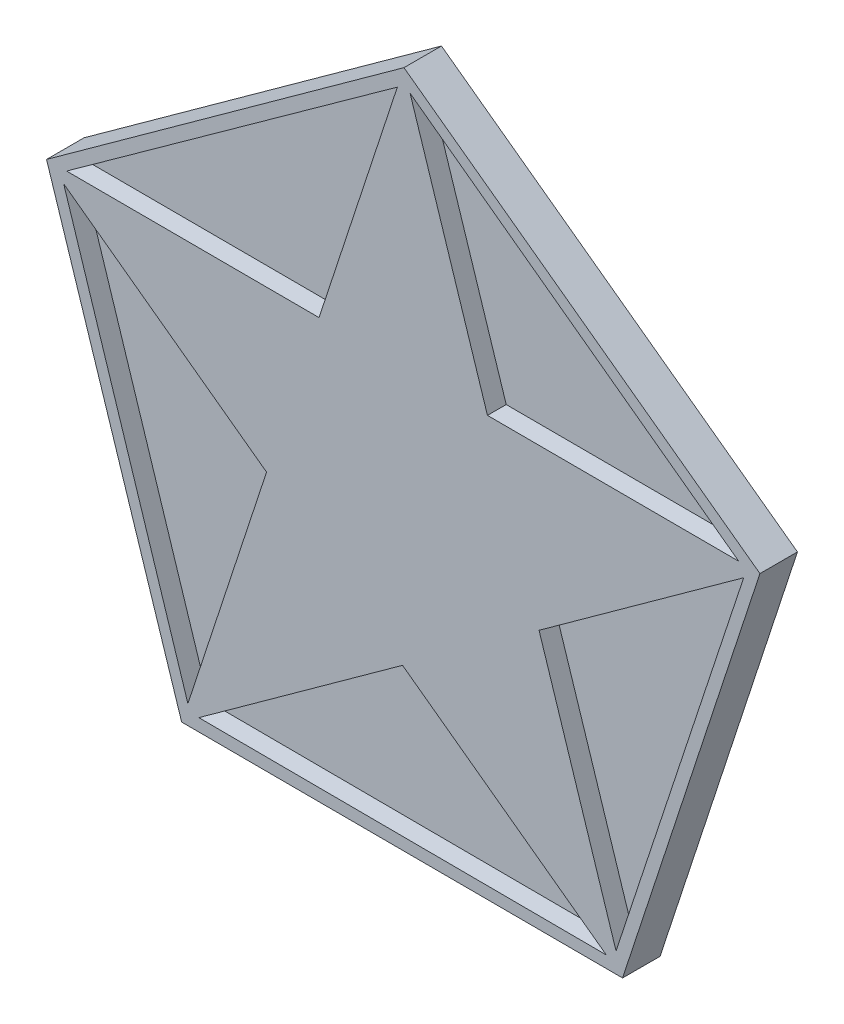
ISO-10303-21;
HEADER;
FILE_DESCRIPTION(('STEP AP214'),'2;1');
FILE_NAME('part.step','',(''),(''),'','','');
FILE_SCHEMA(('AUTOMOTIVE_DESIGN { 1 0 10303 214 1 1 1 1 }'));
ENDSEC;
DATA;
#1=APPLICATION_CONTEXT('core data for automotive mechanical design processes');
#2=APPLICATION_PROTOCOL_DEFINITION('international standard','automotive_design',2000,#1);
#3=PRODUCT_CONTEXT('',#1,'mechanical');
#4=PRODUCT('Part','Part','',(#3));
#5=PRODUCT_RELATED_PRODUCT_CATEGORY('part','',(#4));
#6=PRODUCT_DEFINITION_FORMATION('','',#4);
#7=PRODUCT_DEFINITION_CONTEXT('part definition',#1,'design');
#8=PRODUCT_DEFINITION('design','',#6,#7);
#9=PRODUCT_DEFINITION_SHAPE('','',#8);
#10=(LENGTH_UNIT() NAMED_UNIT(*) SI_UNIT(.MILLI.,.METRE.));
#11=(NAMED_UNIT(*) PLANE_ANGLE_UNIT() SI_UNIT($,.RADIAN.));
#12=(NAMED_UNIT(*) SI_UNIT($,.STERADIAN.) SOLID_ANGLE_UNIT());
#13=UNCERTAINTY_MEASURE_WITH_UNIT(LENGTH_MEASURE(1.E-05),#10,'distance_accuracy_value','');
#14=(GEOMETRIC_REPRESENTATION_CONTEXT(3) GLOBAL_UNCERTAINTY_ASSIGNED_CONTEXT((#13)) GLOBAL_UNIT_ASSIGNED_CONTEXT((#10,
#11,#12)) REPRESENTATION_CONTEXT('',''));
#15=CARTESIAN_POINT('',(0.,0.,0.));
#16=DIRECTION('',(0.,0.,1.));
#17=DIRECTION('',(1.,0.,0.));
#18=AXIS2_PLACEMENT_3D('',#15,#16,#17);
#19=CARTESIAN_POINT('',(9.14352620552275,2.92616651290582,0.5));
#20=DIRECTION('',(0.591365593008387,0.806403580972852,0.));
#21=DIRECTION('',(-0.806403580972852,0.591365593008387,0.));
#22=AXIS2_PLACEMENT_3D('',#19,#20,#21);
#23=PLANE('',#22);
#24=DIRECTION('',(0.,0.,-1.));
#25=VECTOR('',#24,1.);
#26=CARTESIAN_POINT('',(8.95345340474089,3.06555393280484,0.5));
#27=LINE('',#26,#25);
#28=CARTESIAN_POINT('',(8.95345340474089,3.06555393280484,1.));
#29=VERTEX_POINT('',#28);
#30=CARTESIAN_POINT('',(8.95345340474089,3.06555393280484,0.5));
#31=VERTEX_POINT('',#30);
#32=EDGE_CURVE('E332',#29,#31,#27,.T.);
#33=ORIENTED_EDGE('',*,*,#32,.F.);
#34=DIRECTION('',(-0.806403580972852,0.591365593008387,0.));
#35=VECTOR('',#34,1.);
#36=CARTESIAN_POINT('',(9.14352620552275,2.92616651290582,1.));
#37=LINE('',#36,#35);
#38=CARTESIAN_POINT('',(0.191271851090953,9.49118597708489,1.));
#39=VERTEX_POINT('',#38);
#40=EDGE_CURVE('E211',#29,#39,#37,.T.);
#41=ORIENTED_EDGE('',*,*,#40,.T.);
#42=DIRECTION('',(0.,0.,1.));
#43=VECTOR('',#42,1.);
#44=CARTESIAN_POINT('',(0.191271851090953,9.49118597708489,0.5));
#45=LINE('',#44,#43);
#46=CARTESIAN_POINT('',(0.191271851090954,9.49118597708489,0.5));
#47=VERTEX_POINT('',#46);
#48=EDGE_CURVE('E336',#47,#39,#45,.T.);
#49=ORIENTED_EDGE('',*,*,#48,.F.);
#50=DIRECTION('',(-0.806403580972852,0.591365593008387,0.));
#51=VECTOR('',#50,1.);
#52=CARTESIAN_POINT('',(9.14352620552275,2.92616651290582,0.5));
#53=LINE('',#52,#51);
#54=EDGE_CURVE('E231',#31,#47,#53,.T.);
#55=ORIENTED_EDGE('',*,*,#54,.F.);
#56=EDGE_LOOP('',(#33,#41,#49,#55));
#57=FACE_BOUND('',#56,.T.);
#58=ADVANCED_FACE('F45',(#57),#23,.F.);
#59=CARTESIAN_POINT('',(5.60845471588296,-7.79177499881913,0.5));
#60=DIRECTION('',(0.949677398576187,-0.313229689897949,0.));
#61=DIRECTION('',(0.313229689897949,0.949677398576187,0.));
#62=AXIS2_PLACEMENT_3D('',#59,#60,#61);
#63=PLANE('',#62);
#64=DIRECTION('',(0.,0.,-1.));
#65=VECTOR('',#64,1.);
#66=CARTESIAN_POINT('',(5.68228430425744,-7.5679319415142,0.5));
#67=LINE('',#66,#65);
#68=CARTESIAN_POINT('',(5.68228430425744,-7.5679319415142,1.));
#69=VERTEX_POINT('',#68);
#70=CARTESIAN_POINT('',(5.68228430425744,-7.56793194151421,0.5));
#71=VERTEX_POINT('',#70);
#72=EDGE_CURVE('E198',#69,#71,#67,.T.);
#73=ORIENTED_EDGE('',*,*,#72,.F.);
#74=DIRECTION('',(0.313229689897949,0.949677398576187,0.));
#75=VECTOR('',#74,1.);
#76=CARTESIAN_POINT('',(5.60845471588296,-7.79177499881913,1.));
#77=LINE('',#76,#75);
#78=CARTESIAN_POINT('',(9.08576052340843,2.75102742332854,1.));
#79=VERTEX_POINT('',#78);
#80=EDGE_CURVE('E228',#69,#79,#77,.T.);
#81=ORIENTED_EDGE('',*,*,#80,.T.);
#82=DIRECTION('',(0.,0.,1.));
#83=VECTOR('',#82,1.);
#84=CARTESIAN_POINT('',(9.08576052340843,2.75102742332853,0.5));
#85=LINE('',#84,#83);
#86=CARTESIAN_POINT('',(9.08576052340843,2.75102742332853,0.5));
#87=VERTEX_POINT('',#86);
#88=EDGE_CURVE('E201',#87,#79,#85,.T.);
#89=ORIENTED_EDGE('',*,*,#88,.F.);
#90=DIRECTION('',(0.313229689897949,0.949677398576187,0.));
#91=VECTOR('',#90,1.);
#92=CARTESIAN_POINT('',(5.60845471588296,-7.79177499881913,0.5));
#93=LINE('',#92,#91);
#94=EDGE_CURVE('E141',#71,#87,#93,.T.);
#95=ORIENTED_EDGE('',*,*,#94,.F.);
#96=EDGE_LOOP('',(#73,#81,#89,#95));
#97=FACE_BOUND('',#96,.T.);
#98=ADVANCED_FACE('F196',(#97),#63,.F.);
#99=CARTESIAN_POINT('',(-5.67731056674244,-7.74174829486772,0.5));
#100=DIRECTION('',(-0.00443268234072224,-0.999990175615374,0.));
#101=DIRECTION('',(0.999990175615374,-0.00443268234072224,0.));
#102=AXIS2_PLACEMENT_3D('',#99,#100,#101);
#103=PLANE('',#102);
#104=DIRECTION('',(0.,0.,-1.));
#105=VECTOR('',#104,1.);
#106=CARTESIAN_POINT('',(-5.44160857096974,-7.74279309720659,0.5));
#107=LINE('',#106,#105);
#108=CARTESIAN_POINT('',(-5.44160857096974,-7.74279309720659,1.));
#109=VERTEX_POINT('',#108);
#110=CARTESIAN_POINT('',(-5.44160857096975,-7.7427930972066,0.5));
#111=VERTEX_POINT('',#110);
#112=EDGE_CURVE('E306',#109,#111,#107,.T.);
#113=ORIENTED_EDGE('',*,*,#112,.F.);
#114=DIRECTION('',(0.999990175615374,-0.00443268234072224,0.));
#115=VECTOR('',#114,1.);
#116=CARTESIAN_POINT('',(-5.67731056674244,-7.74174829486772,1.));
#117=LINE('',#116,#115);
#118=CARTESIAN_POINT('',(5.42403696601749,-7.79095752548481,1.));
#119=VERTEX_POINT('',#118);
#120=EDGE_CURVE('E224',#109,#119,#117,.T.);
#121=ORIENTED_EDGE('',*,*,#120,.T.);
#122=DIRECTION('',(0.,0.,1.));
#123=VECTOR('',#122,1.);
#124=CARTESIAN_POINT('',(5.42403696601749,-7.79095752548481,0.5));
#125=LINE('',#124,#123);
#126=CARTESIAN_POINT('',(5.42403696601749,-7.79095752548481,0.5));
#127=VERTEX_POINT('',#126);
#128=EDGE_CURVE('E324',#127,#119,#125,.T.);
#129=ORIENTED_EDGE('',*,*,#128,.F.);
#130=DIRECTION('',(0.999990175615374,-0.00443268234072224,0.));
#131=VECTOR('',#130,1.);
#132=CARTESIAN_POINT('',(-5.67731056674244,-7.74174829486772,0.5));
#133=LINE('',#132,#131);
#134=EDGE_CURVE('E203',#111,#127,#133,.T.);
#135=ORIENTED_EDGE('',*,*,#134,.F.);
#136=EDGE_LOOP('',(#113,#121,#129,#135));
#137=FACE_BOUND('',#136,.T.);
#138=ADVANCED_FACE('F260',(#137),#103,.F.);
#139=CARTESIAN_POINT('',(-9.11722561081872,3.00711142024433,0.5));
#140=DIRECTION('',(-0.952416946924085,-0.304798227048328,0.));
#141=DIRECTION('',(0.304798227048328,-0.952416946924085,0.));
#142=AXIS2_PLACEMENT_3D('',#139,#140,#141);
#143=PLANE('',#142);
#144=DIRECTION('',(0.,0.,1.));
#145=VECTOR('',#144,1.);
#146=CARTESIAN_POINT('',(-5.73352132217376,-7.56610397898492,0.5));
#147=LINE('',#146,#145);
#148=CARTESIAN_POINT('',(-5.73352132217376,-7.56610397898492,0.5));
#149=VERTEX_POINT('',#148);
#150=CARTESIAN_POINT('',(-5.73352132217376,-7.56610397898493,1.));
#151=VERTEX_POINT('',#150);
#152=EDGE_CURVE('E216',#149,#151,#147,.T.);
#153=ORIENTED_EDGE('',*,*,#152,.F.);
#154=DIRECTION('',(0.304798227048328,-0.952416946924085,0.));
#155=VECTOR('',#154,1.);
#156=CARTESIAN_POINT('',(-9.11722561081872,3.00711142024433,0.5));
#157=LINE('',#156,#155);
#158=CARTESIAN_POINT('',(-9.04538335458949,2.78262263958246,0.5));
#159=VERTEX_POINT('',#158);
#160=EDGE_CURVE('E207',#159,#149,#157,.T.);
#161=ORIENTED_EDGE('',*,*,#160,.F.);
#162=DIRECTION('',(0.,0.,-1.));
#163=VECTOR('',#162,1.);
#164=CARTESIAN_POINT('',(-9.04538335458949,2.78262263958246,0.5));
#165=LINE('',#164,#163);
#166=CARTESIAN_POINT('',(-9.04538335458949,2.78262263958246,1.));
#167=VERTEX_POINT('',#166);
#168=EDGE_CURVE('E61',#167,#159,#165,.T.);
#169=ORIENTED_EDGE('',*,*,#168,.F.);
#170=DIRECTION('',(0.304798227048328,-0.952416946924085,0.));
#171=VECTOR('',#170,1.);
#172=CARTESIAN_POINT('',(-9.11722561081872,3.00711142024433,1.));
#173=LINE('',#172,#171);
#174=EDGE_CURVE('E220',#167,#151,#173,.T.);
#175=ORIENTED_EDGE('',*,*,#174,.T.);
#176=EDGE_LOOP('',(#153,#161,#169,#175));
#177=FACE_BOUND('',#176,.T.);
#178=ADVANCED_FACE('F288',(#177),#143,.F.);
#179=CARTESIAN_POINT('',(0.0425552561554533,9.60024536053669,0.5));
#180=DIRECTION('',(-0.584193362319767,0.811614511588799,0.));
#181=DIRECTION('',(-0.811614511588799,-0.584193362319767,0.));
#182=AXIS2_PLACEMENT_3D('',#179,#180,#181);
#183=PLANE('',#182);
#184=DIRECTION('',(0.,0.,-1.));
#185=VECTOR('',#184,1.);
#186=CARTESIAN_POINT('',(-0.148745783439104,9.46254846633351,0.5));
#187=LINE('',#186,#185);
#188=CARTESIAN_POINT('',(-0.148745783439104,9.46254846633351,1.));
#189=VERTEX_POINT('',#188);
#190=CARTESIAN_POINT('',(-0.148745783439103,9.46254846633351,0.5));
#191=VERTEX_POINT('',#190);
#192=EDGE_CURVE('E340',#189,#191,#187,.T.);
#193=ORIENTED_EDGE('',*,*,#192,.F.);
#194=DIRECTION('',(-0.811614511588799,-0.584193362319767,0.));
#195=VECTOR('',#194,1.);
#196=CARTESIAN_POINT('',(0.0425552561554533,9.60024536053669,1.));
#197=LINE('',#196,#195);
#198=CARTESIAN_POINT('',(-8.96754801834311,3.11484810405631,1.));
#199=VERTEX_POINT('',#198);
#200=EDGE_CURVE('E215',#189,#199,#197,.T.);
#201=ORIENTED_EDGE('',*,*,#200,.T.);
#202=DIRECTION('',(0.,0.,1.));
#203=VECTOR('',#202,1.);
#204=CARTESIAN_POINT('',(-8.96754801834311,3.11484810405631,0.5));
#205=LINE('',#204,#203);
#206=CARTESIAN_POINT('',(-8.96754801834311,3.11484810405631,0.5));
#207=VERTEX_POINT('',#206);
#208=EDGE_CURVE('E344',#207,#199,#205,.T.);
#209=ORIENTED_EDGE('',*,*,#208,.F.);
#210=DIRECTION('',(-0.811614511588799,-0.584193362319767,0.));
#211=VECTOR('',#210,1.);
#212=CARTESIAN_POINT('',(0.0425552561554533,9.60024536053669,0.5));
#213=LINE('',#212,#211);
#214=EDGE_CURVE('E313',#191,#207,#213,.T.);
#215=ORIENTED_EDGE('',*,*,#214,.F.);
#216=EDGE_LOOP('',(#193,#201,#209,#215));
#217=FACE_BOUND('',#216,.T.);
#218=ADVANCED_FACE('F264',(#217),#183,.F.);
#219=CARTESIAN_POINT('',(0.,0.,0.5));
#220=DIRECTION('',(0.,0.,1.));
#221=DIRECTION('',(1.,0.,0.));
#222=AXIS2_PLACEMENT_3D('',#219,#220,#221);
#223=PLANE('',#222);
#224=DIRECTION('',(0.807397156078042,-0.59000833244717,0.));
#225=VECTOR('',#224,1.);
#226=CARTESIAN_POINT('',(5.85557724977198,-8.10630711680435,0.5));
#227=LINE('',#226,#225);
#228=CARTESIAN_POINT('',(-0.0105064590408157,-3.81964566280041,0.5));
#229=VERTEX_POINT('',#228);
#230=EDGE_CURVE('E381',#229,#127,#227,.T.);
#231=ORIENTED_EDGE('',*,*,#230,.F.);
#232=DIRECTION('',(-0.810630711680435,-0.585557724977198,0.));
#233=VECTOR('',#232,1.);
#234=CARTESIAN_POINT('',(1.80947288205486,-2.50498666071512,0.5));
#235=LINE('',#234,#233);
#236=EDGE_CURVE('E11',#229,#111,#235,.T.);
#237=ORIENTED_EDGE('',*,*,#236,.T.);
#238=ORIENTED_EDGE('',*,*,#134,.T.);
#239=EDGE_LOOP('',(#231,#237,#238));
#240=FACE_BOUND('',#239,.T.);
#241=ADVANCED_FACE('F282',(#240),#223,.T.);
#242=DIRECTION('',(0.810630711680434,0.585557724977198,0.));
#243=VECTOR('',#242,1.);
#244=CARTESIAN_POINT('',(3.62945222315053,-1.19032765862984,0.5));
#245=LINE('',#244,#243);
#246=CARTESIAN_POINT('',(3.62945222315053,-1.19032765862984,0.5));
#247=VERTEX_POINT('',#246);
#248=EDGE_CURVE('E185',#247,#87,#245,.T.);
#249=ORIENTED_EDGE('',*,*,#248,.F.);
#250=DIRECTION('',(0.306399823935017,-0.951902908858141,0.));
#251=VECTOR('',#250,1.);
#252=CARTESIAN_POINT('',(2.94154175832112,0.946827526694121,0.5));
#253=LINE('',#252,#251);
#254=EDGE_CURVE('E54',#247,#71,#253,.T.);
#255=ORIENTED_EDGE('',*,*,#254,.T.);
#256=ORIENTED_EDGE('',*,*,#94,.T.);
#257=EDGE_LOOP('',(#249,#255,#256));
#258=FACE_BOUND('',#257,.T.);
#259=ADVANCED_FACE('F181',(#258),#223,.T.);
#260=DIRECTION('',(-0.306399823935017,0.951902908858141,0.));
#261=VECTOR('',#260,1.);
#262=CARTESIAN_POINT('',(2.25363129349171,3.08398271201809,0.5));
#263=LINE('',#262,#261);
#264=CARTESIAN_POINT('',(2.25363129349171,3.08398271201809,0.5));
#265=VERTEX_POINT('',#264);
#266=EDGE_CURVE('E375',#265,#47,#263,.T.);
#267=ORIENTED_EDGE('',*,*,#266,.F.);
#268=DIRECTION('',(0.999996217019259,-0.0027506266870268,0.));
#269=VECTOR('',#268,1.);
#270=CARTESIAN_POINT('',(0.00849990391472541,3.09015825369609,0.5));
#271=LINE('',#270,#269);
#272=EDGE_CURVE('E170',#265,#31,#271,.T.);
#273=ORIENTED_EDGE('',*,*,#272,.T.);
#274=ORIENTED_EDGE('',*,*,#54,.T.);
#275=EDGE_LOOP('',(#267,#273,#274));
#276=FACE_BOUND('',#275,.T.);
#277=ADVANCED_FACE('F499',(#276),#223,.T.);
#278=DIRECTION('',(-0.999996217019259,0.00275062668702662,0.));
#279=VECTOR('',#278,1.);
#280=CARTESIAN_POINT('',(-9.50202928075196,3.11631826804201,0.5));
#281=LINE('',#280,#279);
#282=CARTESIAN_POINT('',(-2.23663148566227,3.0963337953741,0.5));
#283=VERTEX_POINT('',#282);
#284=EDGE_CURVE('E370',#283,#207,#281,.T.);
#285=ORIENTED_EDGE('',*,*,#284,.F.);
#286=DIRECTION('',(0.311631826804201,0.950202928075196,0.));
#287=VECTOR('',#286,1.);
#288=CARTESIAN_POINT('',(-2.93628852880072,0.962995304706084,0.5));
#289=LINE('',#288,#287);
#290=EDGE_CURVE('E166',#283,#191,#289,.T.);
#291=ORIENTED_EDGE('',*,*,#290,.T.);
#292=ORIENTED_EDGE('',*,*,#214,.T.);
#293=EDGE_LOOP('',(#285,#291,#292));
#294=FACE_BOUND('',#293,.T.);
#295=ADVANCED_FACE('F501',(#294),#223,.T.);
#296=ORIENTED_EDGE('',*,*,#160,.T.);
#297=DIRECTION('',(-0.311631826804201,-0.950202928075196,0.));
#298=VECTOR('',#297,1.);
#299=CARTESIAN_POINT('',(-3.63594557193916,-1.17034318596193,0.5));
#300=LINE('',#299,#298);
#301=CARTESIAN_POINT('',(-3.63594557193916,-1.17034318596193,0.5));
#302=VERTEX_POINT('',#301);
#303=EDGE_CURVE('E311',#302,#149,#300,.T.);
#304=ORIENTED_EDGE('',*,*,#303,.F.);
#305=DIRECTION('',(-0.807397156078042,0.59000833244717,0.));
#306=VECTOR('',#305,1.);
#307=CARTESIAN_POINT('',(-1.82322601548999,-2.49499442438117,0.5));
#308=LINE('',#307,#306);
#309=EDGE_CURVE('E163',#302,#159,#308,.T.);
#310=ORIENTED_EDGE('',*,*,#309,.T.);
#311=EDGE_LOOP('',(#296,#304,#310));
#312=FACE_BOUND('',#311,.T.);
#313=ADVANCED_FACE('F285',(#312),#223,.T.);
#314=CARTESIAN_POINT('',(9.51902908858141,3.06399823935017,1.));
#315=DIRECTION('',(-0.590008332447169,-0.807397156078042,0.));
#316=DIRECTION('',(0.807397156078042,-0.590008332447169,0.));
#317=AXIS2_PLACEMENT_3D('',#314,#315,#316);
#318=PLANE('',#317);
#319=DIRECTION('',(-0.807397156078042,0.590008332447169,0.));
#320=VECTOR('',#319,1.);
#321=CARTESIAN_POINT('',(9.51902908858141,3.06399823935017,0.));
#322=LINE('',#321,#320);
#323=CARTESIAN_POINT('',(9.51902908858141,3.06399823935017,0.));
#324=VERTEX_POINT('',#323);
#325=CARTESIAN_POINT('',(0.0275062668702644,9.99996217019259,0.));
#326=VERTEX_POINT('',#325);
#327=EDGE_CURVE('E137',#324,#326,#322,.T.);
#328=ORIENTED_EDGE('',*,*,#327,.T.);
#329=DIRECTION('',(0.,0.,-1.));
#330=VECTOR('',#329,1.);
#331=CARTESIAN_POINT('',(0.0275062668702644,9.99996217019259,1.));
#332=LINE('',#331,#330);
#333=CARTESIAN_POINT('',(0.0275062668702644,9.99996217019259,1.));
#334=VERTEX_POINT('',#333);
#335=EDGE_CURVE('E160',#334,#326,#332,.T.);
#336=ORIENTED_EDGE('',*,*,#335,.F.);
#337=DIRECTION('',(-0.807397156078042,0.590008332447169,0.));
#338=VECTOR('',#337,1.);
#339=CARTESIAN_POINT('',(9.51902908858141,3.06399823935017,1.));
#340=LINE('',#339,#338);
#341=CARTESIAN_POINT('',(9.51902908858141,3.06399823935017,1.));
#342=VERTEX_POINT('',#341);
#343=EDGE_CURVE('E153',#342,#334,#340,.T.);
#344=ORIENTED_EDGE('',*,*,#343,.F.);
#345=DIRECTION('',(0.,0.,-1.));
#346=VECTOR('',#345,1.);
#347=CARTESIAN_POINT('',(9.51902908858141,3.06399823935017,1.));
#348=LINE('',#347,#346);
#349=EDGE_CURVE('E94',#342,#324,#348,.T.);
#350=ORIENTED_EDGE('',*,*,#349,.T.);
#351=EDGE_LOOP('',(#328,#336,#344,#350));
#352=FACE_BOUND('',#351,.T.);
#353=ADVANCED_FACE('F47',(#352),#318,.F.);
#354=CARTESIAN_POINT('',(0.0275062668702644,9.99996217019259,1.));
#355=DIRECTION('',(0.585557724977198,-0.810630711680435,0.));
#356=DIRECTION('',(0.810630711680435,0.585557724977198,0.));
#357=AXIS2_PLACEMENT_3D('',#354,#355,#356);
#358=PLANE('',#357);
#359=DIRECTION('',(-0.810630711680435,-0.585557724977198,0.));
#360=VECTOR('',#359,1.);
#361=CARTESIAN_POINT('',(0.0275062668702644,9.99996217019259,0.));
#362=LINE('',#361,#360);
#363=CARTESIAN_POINT('',(-9.50202928075196,3.11631826804201,0.));
#364=VERTEX_POINT('',#363);
#365=EDGE_CURVE('E140',#326,#364,#362,.T.);
#366=ORIENTED_EDGE('',*,*,#365,.T.);
#367=DIRECTION('',(0.,0.,-1.));
#368=VECTOR('',#367,1.);
#369=CARTESIAN_POINT('',(-9.50202928075196,3.11631826804201,1.));
#370=LINE('',#369,#368);
#371=CARTESIAN_POINT('',(-9.50202928075196,3.11631826804201,1.));
#372=VERTEX_POINT('',#371);
#373=EDGE_CURVE('E127',#372,#364,#370,.T.);
#374=ORIENTED_EDGE('',*,*,#373,.F.);
#375=DIRECTION('',(-0.810630711680435,-0.585557724977198,0.));
#376=VECTOR('',#375,1.);
#377=CARTESIAN_POINT('',(0.0275062668702644,9.99996217019259,1.));
#378=LINE('',#377,#376);
#379=EDGE_CURVE('E102',#334,#372,#378,.T.);
#380=ORIENTED_EDGE('',*,*,#379,.F.);
#381=ORIENTED_EDGE('',*,*,#335,.T.);
#382=EDGE_LOOP('',(#366,#374,#380,#381));
#383=FACE_BOUND('',#382,.T.);
#384=ADVANCED_FACE('F237',(#383),#358,.F.);
#385=CARTESIAN_POINT('',(-9.50202928075196,3.11631826804201,1.));
#386=DIRECTION('',(0.951902908858141,0.306399823935017,0.));
#387=DIRECTION('',(-0.306399823935017,0.951902908858141,0.));
#388=AXIS2_PLACEMENT_3D('',#385,#386,#387);
#389=PLANE('',#388);
#390=DIRECTION('',(0.306399823935017,-0.951902908858141,0.));
#391=VECTOR('',#390,1.);
#392=CARTESIAN_POINT('',(-9.50202928075196,3.11631826804201,0.));
#393=LINE('',#392,#391);
#394=CARTESIAN_POINT('',(-5.90008332447169,-8.07397156078042,0.));
#395=VERTEX_POINT('',#394);
#396=EDGE_CURVE('E122',#364,#395,#393,.T.);
#397=ORIENTED_EDGE('',*,*,#396,.T.);
#398=DIRECTION('',(0.,0.,-1.));
#399=VECTOR('',#398,1.);
#400=CARTESIAN_POINT('',(-5.90008332447169,-8.07397156078042,1.));
#401=LINE('',#400,#399);
#402=CARTESIAN_POINT('',(-5.90008332447169,-8.07397156078042,1.));
#403=VERTEX_POINT('',#402);
#404=EDGE_CURVE('E119',#403,#395,#401,.T.);
#405=ORIENTED_EDGE('',*,*,#404,.F.);
#406=DIRECTION('',(0.306399823935017,-0.951902908858141,0.));
#407=VECTOR('',#406,1.);
#408=CARTESIAN_POINT('',(-9.50202928075196,3.11631826804201,1.));
#409=LINE('',#408,#407);
#410=EDGE_CURVE('E108',#372,#403,#409,.T.);
#411=ORIENTED_EDGE('',*,*,#410,.F.);
#412=ORIENTED_EDGE('',*,*,#373,.T.);
#413=EDGE_LOOP('',(#397,#405,#411,#412));
#414=FACE_BOUND('',#413,.T.);
#415=ADVANCED_FACE('F120',(#414),#389,.F.);
#416=CARTESIAN_POINT('',(-5.90008332447169,-8.07397156078042,1.));
#417=DIRECTION('',(0.00275062668702626,0.999996217019259,0.));
#418=DIRECTION('',(-0.999996217019259,0.00275062668702626,0.));
#419=AXIS2_PLACEMENT_3D('',#416,#417,#418);
#420=PLANE('',#419);
#421=DIRECTION('',(0.999996217019259,-0.00275062668702626,0.));
#422=VECTOR('',#421,1.);
#423=CARTESIAN_POINT('',(-5.90008332447169,-8.07397156078042,0.));
#424=LINE('',#423,#422);
#425=CARTESIAN_POINT('',(5.85557724977198,-8.10630711680435,0.));
#426=VERTEX_POINT('',#425);
#427=EDGE_CURVE('E147',#395,#426,#424,.T.);
#428=ORIENTED_EDGE('',*,*,#427,.T.);
#429=DIRECTION('',(0.,0.,-1.));
#430=VECTOR('',#429,1.);
#431=CARTESIAN_POINT('',(5.85557724977198,-8.10630711680435,1.));
#432=LINE('',#431,#430);
#433=CARTESIAN_POINT('',(5.85557724977198,-8.10630711680435,1.));
#434=VERTEX_POINT('',#433);
#435=EDGE_CURVE('E128',#434,#426,#432,.T.);
#436=ORIENTED_EDGE('',*,*,#435,.F.);
#437=DIRECTION('',(0.999996217019259,-0.00275062668702626,0.));
#438=VECTOR('',#437,1.);
#439=CARTESIAN_POINT('',(-5.90008332447169,-8.07397156078042,1.));
#440=LINE('',#439,#438);
#441=EDGE_CURVE('E113',#403,#434,#440,.T.);
#442=ORIENTED_EDGE('',*,*,#441,.F.);
#443=ORIENTED_EDGE('',*,*,#404,.T.);
#444=EDGE_LOOP('',(#428,#436,#442,#443));
#445=FACE_BOUND('',#444,.T.);
#446=ADVANCED_FACE('F130',(#445),#420,.F.);
#447=CARTESIAN_POINT('',(5.85557724977198,-8.10630711680435,1.));
#448=DIRECTION('',(-0.950202928075196,0.311631826804201,0.));
#449=DIRECTION('',(-0.311631826804201,-0.950202928075196,0.));
#450=AXIS2_PLACEMENT_3D('',#447,#448,#449);
#451=PLANE('',#450);
#452=DIRECTION('',(0.311631826804201,0.950202928075196,0.));
#453=VECTOR('',#452,1.);
#454=CARTESIAN_POINT('',(5.85557724977198,-8.10630711680435,0.));
#455=LINE('',#454,#453);
#456=EDGE_CURVE('E150',#426,#324,#455,.T.);
#457=ORIENTED_EDGE('',*,*,#456,.T.);
#458=ORIENTED_EDGE('',*,*,#349,.F.);
#459=DIRECTION('',(0.311631826804201,0.950202928075196,0.));
#460=VECTOR('',#459,1.);
#461=CARTESIAN_POINT('',(5.85557724977198,-8.10630711680435,1.));
#462=LINE('',#461,#460);
#463=EDGE_CURVE('E70',#434,#342,#462,.T.);
#464=ORIENTED_EDGE('',*,*,#463,.F.);
#465=ORIENTED_EDGE('',*,*,#435,.T.);
#466=EDGE_LOOP('',(#457,#458,#464,#465));
#467=FACE_BOUND('',#466,.T.);
#468=ADVANCED_FACE('F242',(#467),#451,.F.);
#469=CARTESIAN_POINT('',(0.,0.,1.));
#470=DIRECTION('',(0.,0.,1.));
#471=DIRECTION('',(1.,0.,0.));
#472=AXIS2_PLACEMENT_3D('',#469,#470,#471);
#473=PLANE('',#472);
#474=DIRECTION('',(-0.311631826804201,-0.950202928075196,0.));
#475=VECTOR('',#474,1.);
#476=CARTESIAN_POINT('',(-3.63594557193916,-1.17034318596193,1.));
#477=LINE('',#476,#475);
#478=CARTESIAN_POINT('',(-3.63594557193916,-1.17034318596193,1.));
#479=VERTEX_POINT('',#478);
#480=EDGE_CURVE('E374',#479,#151,#477,.T.);
#481=ORIENTED_EDGE('',*,*,#480,.T.);
#482=ORIENTED_EDGE('',*,*,#174,.F.);
#483=DIRECTION('',(0.807397156078042,-0.59000833244717,0.));
#484=VECTOR('',#483,1.);
#485=CARTESIAN_POINT('',(-3.63594557193916,-1.17034318596193,1.));
#486=LINE('',#485,#484);
#487=EDGE_CURVE('E369',#167,#479,#486,.T.);
#488=ORIENTED_EDGE('',*,*,#487,.T.);
#489=EDGE_LOOP('',(#481,#482,#488));
#490=FACE_BOUND('',#489,.T.);
#491=ORIENTED_EDGE('',*,*,#410,.T.);
#492=ORIENTED_EDGE('',*,*,#441,.T.);
#493=ORIENTED_EDGE('',*,*,#463,.T.);
#494=ORIENTED_EDGE('',*,*,#343,.T.);
#495=ORIENTED_EDGE('',*,*,#379,.T.);
#496=EDGE_LOOP('',(#491,#492,#493,#494,#495));
#497=FACE_BOUND('',#496,.T.);
#498=DIRECTION('',(0.807397156078042,-0.59000833244717,0.));
#499=VECTOR('',#498,1.);
#500=CARTESIAN_POINT('',(5.85557724977198,-8.10630711680435,1.));
#501=LINE('',#500,#499);
#502=CARTESIAN_POINT('',(-0.0105064590408157,-3.81964566280041,1.));
#503=VERTEX_POINT('',#502);
#504=EDGE_CURVE('E414',#503,#119,#501,.T.);
#505=ORIENTED_EDGE('',*,*,#504,.T.);
#506=ORIENTED_EDGE('',*,*,#120,.F.);
#507=DIRECTION('',(0.810630711680434,0.585557724977198,0.));
#508=VECTOR('',#507,1.);
#509=CARTESIAN_POINT('',(-5.90008332447169,-8.07397156078042,1.));
#510=LINE('',#509,#508);
#511=EDGE_CURVE('E418',#109,#503,#510,.T.);
#512=ORIENTED_EDGE('',*,*,#511,.T.);
#513=EDGE_LOOP('',(#505,#506,#512));
#514=FACE_BOUND('',#513,.T.);
#515=DIRECTION('',(0.810630711680434,0.585557724977198,0.));
#516=VECTOR('',#515,1.);
#517=CARTESIAN_POINT('',(3.62945222315053,-1.19032765862984,1.));
#518=LINE('',#517,#516);
#519=CARTESIAN_POINT('',(3.62945222315053,-1.19032765862984,1.));
#520=VERTEX_POINT('',#519);
#521=EDGE_CURVE('E406',#520,#79,#518,.T.);
#522=ORIENTED_EDGE('',*,*,#521,.T.);
#523=ORIENTED_EDGE('',*,*,#80,.F.);
#524=DIRECTION('',(-0.306399823935017,0.951902908858141,0.));
#525=VECTOR('',#524,1.);
#526=CARTESIAN_POINT('',(5.85557724977198,-8.10630711680435,1.));
#527=LINE('',#526,#525);
#528=EDGE_CURVE('E410',#69,#520,#527,.T.);
#529=ORIENTED_EDGE('',*,*,#528,.T.);
#530=EDGE_LOOP('',(#522,#523,#529));
#531=FACE_BOUND('',#530,.T.);
#532=DIRECTION('',(-0.306399823935017,0.951902908858141,0.));
#533=VECTOR('',#532,1.);
#534=CARTESIAN_POINT('',(2.25363129349171,3.08398271201809,1.));
#535=LINE('',#534,#533);
#536=CARTESIAN_POINT('',(2.25363129349171,3.08398271201809,1.));
#537=VERTEX_POINT('',#536);
#538=EDGE_CURVE('E398',#537,#39,#535,.T.);
#539=ORIENTED_EDGE('',*,*,#538,.T.);
#540=ORIENTED_EDGE('',*,*,#40,.F.);
#541=DIRECTION('',(-0.999996217019259,0.0027506266870268,0.));
#542=VECTOR('',#541,1.);
#543=CARTESIAN_POINT('',(2.25363129349171,3.08398271201809,1.));
#544=LINE('',#543,#542);
#545=EDGE_CURVE('E402',#29,#537,#544,.T.);
#546=ORIENTED_EDGE('',*,*,#545,.T.);
#547=EDGE_LOOP('',(#539,#540,#546));
#548=FACE_BOUND('',#547,.T.);
#549=ORIENTED_EDGE('',*,*,#200,.F.);
#550=DIRECTION('',(-0.311631826804201,-0.950202928075196,0.));
#551=VECTOR('',#550,1.);
#552=CARTESIAN_POINT('',(0.0275062668702644,9.99996217019259,1.));
#553=LINE('',#552,#551);
#554=CARTESIAN_POINT('',(-2.23663148566227,3.0963337953741,1.));
#555=VERTEX_POINT('',#554);
#556=EDGE_CURVE('E394',#189,#555,#553,.T.);
#557=ORIENTED_EDGE('',*,*,#556,.T.);
#558=DIRECTION('',(-0.999996217019259,0.00275062668702662,0.));
#559=VECTOR('',#558,1.);
#560=CARTESIAN_POINT('',(-9.50202928075196,3.11631826804201,1.));
#561=LINE('',#560,#559);
#562=EDGE_CURVE('E390',#555,#199,#561,.T.);
#563=ORIENTED_EDGE('',*,*,#562,.T.);
#564=EDGE_LOOP('',(#549,#557,#563));
#565=FACE_BOUND('',#564,.T.);
#566=ADVANCED_FACE('F110',(#490,#497,#514,#531,#548,#565),#473,.T.);
#567=CARTESIAN_POINT('',(0.,0.,0.));
#568=DIRECTION('',(0.,0.,1.));
#569=DIRECTION('',(1.,0.,0.));
#570=AXIS2_PLACEMENT_3D('',#567,#568,#569);
#571=PLANE('',#570);
#572=ORIENTED_EDGE('',*,*,#327,.F.);
#573=ORIENTED_EDGE('',*,*,#456,.F.);
#574=ORIENTED_EDGE('',*,*,#427,.F.);
#575=ORIENTED_EDGE('',*,*,#396,.F.);
#576=ORIENTED_EDGE('',*,*,#365,.F.);
#577=EDGE_LOOP('',(#572,#573,#574,#575,#576));
#578=FACE_BOUND('',#577,.T.);
#579=ADVANCED_FACE('F239',(#578),#571,.F.);
#580=CARTESIAN_POINT('',(-3.63594557193916,-1.17034318596193,1.));
#581=DIRECTION('',(0.950202928075196,-0.311631826804201,0.));
#582=DIRECTION('',(0.311631826804201,0.950202928075196,0.));
#583=AXIS2_PLACEMENT_3D('',#580,#581,#582);
#584=PLANE('',#583);
#585=ORIENTED_EDGE('',*,*,#303,.T.);
#586=ORIENTED_EDGE('',*,*,#152,.T.);
#587=ORIENTED_EDGE('',*,*,#480,.F.);
#588=DIRECTION('',(0.,0.,-1.));
#589=VECTOR('',#588,1.);
#590=CARTESIAN_POINT('',(-3.63594557193916,-1.17034318596193,1.));
#591=LINE('',#590,#589);
#592=EDGE_CURVE('E365',#479,#302,#591,.T.);
#593=ORIENTED_EDGE('',*,*,#592,.T.);
#594=EDGE_LOOP('',(#585,#586,#587,#593));
#595=FACE_BOUND('',#594,.T.);
#596=ADVANCED_FACE('F266',(#595),#584,.F.);
#597=CARTESIAN_POINT('',(-5.90008332447169,-8.07397156078042,1.));
#598=DIRECTION('',(-0.585557724977198,0.810630711680434,0.));
#599=DIRECTION('',(-0.810630711680435,-0.585557724977198,0.));
#600=AXIS2_PLACEMENT_3D('',#597,#598,#599);
#601=PLANE('',#600);
#602=ORIENTED_EDGE('',*,*,#511,.F.);
#603=ORIENTED_EDGE('',*,*,#112,.T.);
#604=ORIENTED_EDGE('',*,*,#236,.F.);
#605=DIRECTION('',(0.,0.,-1.));
#606=VECTOR('',#605,1.);
#607=CARTESIAN_POINT('',(-0.0105064590408157,-3.81964566280041,1.));
#608=LINE('',#607,#606);
#609=EDGE_CURVE('E350',#503,#229,#608,.T.);
#610=ORIENTED_EDGE('',*,*,#609,.F.);
#611=EDGE_LOOP('',(#602,#603,#604,#610));
#612=FACE_BOUND('',#611,.T.);
#613=ADVANCED_FACE('F270',(#612),#601,.F.);
#614=CARTESIAN_POINT('',(5.85557724977198,-8.10630711680435,1.));
#615=DIRECTION('',(0.59000833244717,0.807397156078042,0.));
#616=DIRECTION('',(-0.807397156078042,0.59000833244717,0.));
#617=AXIS2_PLACEMENT_3D('',#614,#615,#616);
#618=PLANE('',#617);
#619=ORIENTED_EDGE('',*,*,#230,.T.);
#620=ORIENTED_EDGE('',*,*,#128,.T.);
#621=ORIENTED_EDGE('',*,*,#504,.F.);
#622=ORIENTED_EDGE('',*,*,#609,.T.);
#623=EDGE_LOOP('',(#619,#620,#621,#622));
#624=FACE_BOUND('',#623,.T.);
#625=ADVANCED_FACE('F276',(#624),#618,.F.);
#626=CARTESIAN_POINT('',(5.85557724977198,-8.10630711680435,1.));
#627=DIRECTION('',(-0.951902908858141,-0.306399823935017,0.));
#628=DIRECTION('',(0.306399823935017,-0.951902908858141,0.));
#629=AXIS2_PLACEMENT_3D('',#626,#627,#628);
#630=PLANE('',#629);
#631=ORIENTED_EDGE('',*,*,#528,.F.);
#632=ORIENTED_EDGE('',*,*,#72,.T.);
#633=ORIENTED_EDGE('',*,*,#254,.F.);
#634=DIRECTION('',(0.,0.,-1.));
#635=VECTOR('',#634,1.);
#636=CARTESIAN_POINT('',(3.62945222315053,-1.19032765862984,1.));
#637=LINE('',#636,#635);
#638=EDGE_CURVE('E354',#520,#247,#637,.T.);
#639=ORIENTED_EDGE('',*,*,#638,.F.);
#640=EDGE_LOOP('',(#631,#632,#633,#639));
#641=FACE_BOUND('',#640,.T.);
#642=ADVANCED_FACE('F567',(#641),#630,.F.);
#643=CARTESIAN_POINT('',(3.62945222315053,-1.19032765862984,1.));
#644=DIRECTION('',(-0.585557724977198,0.810630711680434,0.));
#645=DIRECTION('',(-0.810630711680435,-0.585557724977198,0.));
#646=AXIS2_PLACEMENT_3D('',#643,#644,#645);
#647=PLANE('',#646);
#648=ORIENTED_EDGE('',*,*,#248,.T.);
#649=ORIENTED_EDGE('',*,*,#88,.T.);
#650=ORIENTED_EDGE('',*,*,#521,.F.);
#651=ORIENTED_EDGE('',*,*,#638,.T.);
#652=EDGE_LOOP('',(#648,#649,#650,#651));
#653=FACE_BOUND('',#652,.T.);
#654=ADVANCED_FACE('F575',(#653),#647,.F.);
#655=CARTESIAN_POINT('',(2.25363129349171,3.08398271201809,1.));
#656=DIRECTION('',(-0.0027506266870268,-0.999996217019259,0.));
#657=DIRECTION('',(0.999996217019259,-0.0027506266870268,0.));
#658=AXIS2_PLACEMENT_3D('',#655,#656,#657);
#659=PLANE('',#658);
#660=ORIENTED_EDGE('',*,*,#545,.F.);
#661=ORIENTED_EDGE('',*,*,#32,.T.);
#662=ORIENTED_EDGE('',*,*,#272,.F.);
#663=DIRECTION('',(0.,0.,-1.));
#664=VECTOR('',#663,1.);
#665=CARTESIAN_POINT('',(2.25363129349171,3.08398271201809,1.));
#666=LINE('',#665,#664);
#667=EDGE_CURVE('E357',#537,#265,#666,.T.);
#668=ORIENTED_EDGE('',*,*,#667,.F.);
#669=EDGE_LOOP('',(#660,#661,#662,#668));
#670=FACE_BOUND('',#669,.T.);
#671=ADVANCED_FACE('F492',(#670),#659,.F.);
#672=CARTESIAN_POINT('',(2.25363129349171,3.08398271201809,1.));
#673=DIRECTION('',(-0.951902908858141,-0.306399823935017,0.));
#674=DIRECTION('',(0.306399823935017,-0.951902908858141,0.));
#675=AXIS2_PLACEMENT_3D('',#672,#673,#674);
#676=PLANE('',#675);
#677=ORIENTED_EDGE('',*,*,#266,.T.);
#678=ORIENTED_EDGE('',*,*,#48,.T.);
#679=ORIENTED_EDGE('',*,*,#538,.F.);
#680=ORIENTED_EDGE('',*,*,#667,.T.);
#681=EDGE_LOOP('',(#677,#678,#679,#680));
#682=FACE_BOUND('',#681,.T.);
#683=ADVANCED_FACE('F495',(#682),#676,.F.);
#684=CARTESIAN_POINT('',(0.0275062668702644,9.99996217019259,1.));
#685=DIRECTION('',(0.950202928075196,-0.311631826804201,0.));
#686=DIRECTION('',(0.311631826804201,0.950202928075196,0.));
#687=AXIS2_PLACEMENT_3D('',#684,#685,#686);
#688=PLANE('',#687);
#689=ORIENTED_EDGE('',*,*,#556,.F.);
#690=ORIENTED_EDGE('',*,*,#192,.T.);
#691=ORIENTED_EDGE('',*,*,#290,.F.);
#692=DIRECTION('',(0.,0.,-1.));
#693=VECTOR('',#692,1.);
#694=CARTESIAN_POINT('',(-2.23663148566227,3.0963337953741,1.));
#695=LINE('',#694,#693);
#696=EDGE_CURVE('E361',#555,#283,#695,.T.);
#697=ORIENTED_EDGE('',*,*,#696,.F.);
#698=EDGE_LOOP('',(#689,#690,#691,#697));
#699=FACE_BOUND('',#698,.T.);
#700=ADVANCED_FACE('F601',(#699),#688,.F.);
#701=CARTESIAN_POINT('',(-9.50202928075196,3.11631826804201,1.));
#702=DIRECTION('',(-0.00275062668702662,-0.999996217019259,0.));
#703=DIRECTION('',(0.999996217019259,-0.00275062668702662,0.));
#704=AXIS2_PLACEMENT_3D('',#701,#702,#703);
#705=PLANE('',#704);
#706=ORIENTED_EDGE('',*,*,#284,.T.);
#707=ORIENTED_EDGE('',*,*,#208,.T.);
#708=ORIENTED_EDGE('',*,*,#562,.F.);
#709=ORIENTED_EDGE('',*,*,#696,.T.);
#710=EDGE_LOOP('',(#706,#707,#708,#709));
#711=FACE_BOUND('',#710,.T.);
#712=ADVANCED_FACE('F610',(#711),#705,.F.);
#713=CARTESIAN_POINT('',(-3.63594557193916,-1.17034318596193,1.));
#714=DIRECTION('',(0.59000833244717,0.807397156078042,0.));
#715=DIRECTION('',(-0.807397156078042,0.59000833244717,0.));
#716=AXIS2_PLACEMENT_3D('',#713,#714,#715);
#717=PLANE('',#716);
#718=ORIENTED_EDGE('',*,*,#487,.F.);
#719=ORIENTED_EDGE('',*,*,#168,.T.);
#720=ORIENTED_EDGE('',*,*,#309,.F.);
#721=ORIENTED_EDGE('',*,*,#592,.F.);
#722=EDGE_LOOP('',(#718,#719,#720,#721));
#723=FACE_BOUND('',#722,.T.);
#724=ADVANCED_FACE('F620',(#723),#717,.F.);
#725=CLOSED_SHELL('',(#58,#98,#138,#178,#218,#241,#259,#277,#295,#313,#353,#384,#415,#446,#468,
#566,#579,#596,#613,#625,#642,#654,#671,#683,#700,#712,#724));
#726=MANIFOLD_SOLID_BREP('B2',#725);
#727=ADVANCED_BREP_SHAPE_REPRESENTATION('',(#18,#726),#14);
#728=SHAPE_DEFINITION_REPRESENTATION(#9,#727);
ENDSEC;
END-ISO-10303-21;
